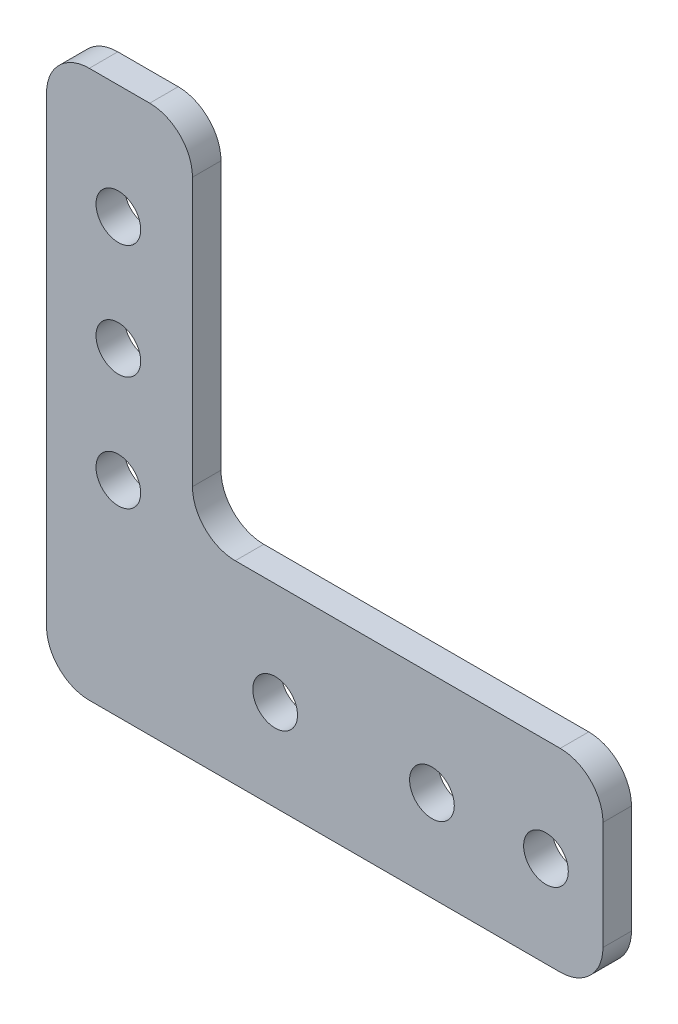
ISO-10303-21;
HEADER;
FILE_DESCRIPTION(('STEP AP214'),'2;1');
FILE_NAME('part.step','',(''),(''),'','','');
FILE_SCHEMA(('AUTOMOTIVE_DESIGN { 1 0 10303 214 1 1 1 1 }'));
ENDSEC;
DATA;
#1=APPLICATION_CONTEXT('core data for automotive mechanical design processes');
#2=APPLICATION_PROTOCOL_DEFINITION('international standard','automotive_design',2000,#1);
#3=PRODUCT_CONTEXT('',#1,'mechanical');
#4=PRODUCT('Part','Part','',(#3));
#5=PRODUCT_RELATED_PRODUCT_CATEGORY('part','',(#4));
#6=PRODUCT_DEFINITION_FORMATION('','',#4);
#7=PRODUCT_DEFINITION_CONTEXT('part definition',#1,'design');
#8=PRODUCT_DEFINITION('design','',#6,#7);
#9=PRODUCT_DEFINITION_SHAPE('','',#8);
#10=(LENGTH_UNIT() NAMED_UNIT(*) SI_UNIT(.MILLI.,.METRE.));
#11=(NAMED_UNIT(*) PLANE_ANGLE_UNIT() SI_UNIT($,.RADIAN.));
#12=(NAMED_UNIT(*) SI_UNIT($,.STERADIAN.) SOLID_ANGLE_UNIT());
#13=UNCERTAINTY_MEASURE_WITH_UNIT(LENGTH_MEASURE(1.E-05),#10,'distance_accuracy_value','');
#14=(GEOMETRIC_REPRESENTATION_CONTEXT(3) GLOBAL_UNCERTAINTY_ASSIGNED_CONTEXT((#13)) GLOBAL_UNIT_ASSIGNED_CONTEXT((#10,
#11,#12)) REPRESENTATION_CONTEXT('',''));
#15=CARTESIAN_POINT('',(0.,0.,0.));
#16=DIRECTION('',(0.,0.,1.));
#17=DIRECTION('',(1.,0.,0.));
#18=AXIS2_PLACEMENT_3D('',#15,#16,#17);
#19=CARTESIAN_POINT('',(-27.051,0.,3.175));
#20=DIRECTION('',(-1.,0.,0.));
#21=DIRECTION('',(0.,0.,1.));
#22=AXIS2_PLACEMENT_3D('',#19,#20,#21);
#23=PLANE('',#22);
#24=DIRECTION('',(0.,1.,0.));
#25=VECTOR('',#24,1.);
#26=CARTESIAN_POINT('',(-27.051,0.,3.175));
#27=LINE('',#26,#25);
#28=CARTESIAN_POINT('',(-27.051,-24.4475,3.175));
#29=VERTEX_POINT('',#28);
#30=CARTESIAN_POINT('',(-27.051,26.9875,3.175));
#31=VERTEX_POINT('',#30);
#32=EDGE_CURVE('E311',#29,#31,#27,.T.);
#33=ORIENTED_EDGE('',*,*,#32,.T.);
#34=DIRECTION('',(0.,0.,-1.));
#35=VECTOR('',#34,1.);
#36=CARTESIAN_POINT('',(-27.051,26.9875,3.175));
#37=LINE('',#36,#35);
#38=CARTESIAN_POINT('',(-27.051,26.9875,0.));
#39=VERTEX_POINT('',#38);
#40=EDGE_CURVE('E143',#31,#39,#37,.T.);
#41=ORIENTED_EDGE('',*,*,#40,.T.);
#42=DIRECTION('',(0.,1.,0.));
#43=VECTOR('',#42,1.);
#44=CARTESIAN_POINT('',(-27.051,0.,0.));
#45=LINE('',#44,#43);
#46=CARTESIAN_POINT('',(-27.051,-24.4475,0.));
#47=VERTEX_POINT('',#46);
#48=EDGE_CURVE('E134',#47,#39,#45,.T.);
#49=ORIENTED_EDGE('',*,*,#48,.F.);
#50=DIRECTION('',(0.,0.,-1.));
#51=VECTOR('',#50,1.);
#52=CARTESIAN_POINT('',(-27.051,-24.4475,3.175));
#53=LINE('',#52,#51);
#54=EDGE_CURVE('E148',#47,#29,#53,.F.);
#55=ORIENTED_EDGE('',*,*,#54,.T.);
#56=EDGE_LOOP('',(#33,#41,#49,#55));
#57=FACE_BOUND('',#56,.T.);
#58=ADVANCED_FACE('F41',(#57),#23,.T.);
#59=CARTESIAN_POINT('',(0.,-29.21,3.175));
#60=DIRECTION('',(0.,1.,0.));
#61=DIRECTION('',(0.,0.,1.));
#62=AXIS2_PLACEMENT_3D('',#59,#60,#61);
#63=PLANE('',#62);
#64=DIRECTION('',(1.,0.,0.));
#65=VECTOR('',#64,1.);
#66=CARTESIAN_POINT('',(0.,-29.21,0.));
#67=LINE('',#66,#65);
#68=CARTESIAN_POINT('',(-22.2885,-29.21,0.));
#69=VERTEX_POINT('',#68);
#70=CARTESIAN_POINT('',(30.1625,-29.21,0.));
#71=VERTEX_POINT('',#70);
#72=EDGE_CURVE('E136',#69,#71,#67,.T.);
#73=ORIENTED_EDGE('',*,*,#72,.T.);
#74=DIRECTION('',(0.,0.,-1.));
#75=VECTOR('',#74,1.);
#76=CARTESIAN_POINT('',(30.1625,-29.21,3.175));
#77=LINE('',#76,#75);
#78=CARTESIAN_POINT('',(30.1625,-29.21,3.175));
#79=VERTEX_POINT('',#78);
#80=EDGE_CURVE('E224',#71,#79,#77,.F.);
#81=ORIENTED_EDGE('',*,*,#80,.T.);
#82=DIRECTION('',(1.,0.,0.));
#83=VECTOR('',#82,1.);
#84=CARTESIAN_POINT('',(0.,-29.21,3.175));
#85=LINE('',#84,#83);
#86=CARTESIAN_POINT('',(-22.2885,-29.21,3.175));
#87=VERTEX_POINT('',#86);
#88=EDGE_CURVE('E314',#87,#79,#85,.T.);
#89=ORIENTED_EDGE('',*,*,#88,.F.);
#90=DIRECTION('',(0.,0.,-1.));
#91=VECTOR('',#90,1.);
#92=CARTESIAN_POINT('',(-22.2885,-29.21,0.));
#93=LINE('',#92,#91);
#94=EDGE_CURVE('E221',#87,#69,#93,.T.);
#95=ORIENTED_EDGE('',*,*,#94,.T.);
#96=EDGE_LOOP('',(#73,#81,#89,#95));
#97=FACE_BOUND('',#96,.T.);
#98=ADVANCED_FACE('F335',(#97),#63,.F.);
#99=CARTESIAN_POINT('',(34.925,0.,3.175));
#100=DIRECTION('',(-1.,0.,0.));
#101=DIRECTION('',(0.,0.,1.));
#102=AXIS2_PLACEMENT_3D('',#99,#100,#101);
#103=PLANE('',#102);
#104=DIRECTION('',(0.,1.,0.));
#105=VECTOR('',#104,1.);
#106=CARTESIAN_POINT('',(34.925,0.,0.));
#107=LINE('',#106,#105);
#108=CARTESIAN_POINT('',(34.925,-24.4475,0.));
#109=VERTEX_POINT('',#108);
#110=CARTESIAN_POINT('',(34.925,-12.3825,0.));
#111=VERTEX_POINT('',#110);
#112=EDGE_CURVE('E240',#109,#111,#107,.T.);
#113=ORIENTED_EDGE('',*,*,#112,.T.);
#114=DIRECTION('',(0.,0.,-1.));
#115=VECTOR('',#114,1.);
#116=CARTESIAN_POINT('',(34.925,-12.3825,3.175));
#117=LINE('',#116,#115);
#118=CARTESIAN_POINT('',(34.925,-12.3825,3.175));
#119=VERTEX_POINT('',#118);
#120=EDGE_CURVE('E218',#111,#119,#117,.F.);
#121=ORIENTED_EDGE('',*,*,#120,.T.);
#122=DIRECTION('',(0.,1.,0.));
#123=VECTOR('',#122,1.);
#124=CARTESIAN_POINT('',(34.925,0.,3.175));
#125=LINE('',#124,#123);
#126=CARTESIAN_POINT('',(34.925,-24.4475,3.175));
#127=VERTEX_POINT('',#126);
#128=EDGE_CURVE('E249',#127,#119,#125,.T.);
#129=ORIENTED_EDGE('',*,*,#128,.F.);
#130=DIRECTION('',(0.,0.,-1.));
#131=VECTOR('',#130,1.);
#132=CARTESIAN_POINT('',(34.925,-24.4475,3.175));
#133=LINE('',#132,#131);
#134=EDGE_CURVE('E214',#127,#109,#133,.T.);
#135=ORIENTED_EDGE('',*,*,#134,.T.);
#136=EDGE_LOOP('',(#113,#121,#129,#135));
#137=FACE_BOUND('',#136,.T.);
#138=ADVANCED_FACE('F330',(#137),#103,.F.);
#139=CARTESIAN_POINT('',(0.,-7.62000000000001,3.175));
#140=DIRECTION('',(0.,-1.,0.));
#141=DIRECTION('',(1.,0.,0.));
#142=AXIS2_PLACEMENT_3D('',#139,#140,#141);
#143=PLANE('',#142);
#144=DIRECTION('',(-1.,0.,0.));
#145=VECTOR('',#144,1.);
#146=CARTESIAN_POINT('',(0.,-7.62000000000001,0.));
#147=LINE('',#146,#145);
#148=CARTESIAN_POINT('',(30.1625,-7.62000000000001,0.));
#149=VERTEX_POINT('',#148);
#150=CARTESIAN_POINT('',(-6.0325,-7.62000000000002,0.));
#151=VERTEX_POINT('',#150);
#152=EDGE_CURVE('E230',#149,#151,#147,.T.);
#153=ORIENTED_EDGE('',*,*,#152,.T.);
#154=DIRECTION('',(0.,0.,-1.));
#155=VECTOR('',#154,1.);
#156=CARTESIAN_POINT('',(-6.0325,-7.62000000000002,3.175));
#157=LINE('',#156,#155);
#158=CARTESIAN_POINT('',(-6.0325,-7.62000000000002,3.175));
#159=VERTEX_POINT('',#158);
#160=EDGE_CURVE('E211',#151,#159,#157,.F.);
#161=ORIENTED_EDGE('',*,*,#160,.T.);
#162=DIRECTION('',(-1.,0.,0.));
#163=VECTOR('',#162,1.);
#164=CARTESIAN_POINT('',(0.,-7.62000000000001,3.175));
#165=LINE('',#164,#163);
#166=CARTESIAN_POINT('',(30.1625,-7.62000000000001,3.175));
#167=VERTEX_POINT('',#166);
#168=EDGE_CURVE('E246',#167,#159,#165,.T.);
#169=ORIENTED_EDGE('',*,*,#168,.F.);
#170=DIRECTION('',(0.,0.,-1.));
#171=VECTOR('',#170,1.);
#172=CARTESIAN_POINT('',(30.1625,-7.62000000000001,3.175));
#173=LINE('',#172,#171);
#174=EDGE_CURVE('E207',#167,#149,#173,.T.);
#175=ORIENTED_EDGE('',*,*,#174,.T.);
#176=EDGE_LOOP('',(#153,#161,#169,#175));
#177=FACE_BOUND('',#176,.T.);
#178=ADVANCED_FACE('F236',(#177),#143,.F.);
#179=CARTESIAN_POINT('',(-10.795,0.,3.175));
#180=DIRECTION('',(1.,0.,0.));
#181=DIRECTION('',(0.,1.,0.));
#182=AXIS2_PLACEMENT_3D('',#179,#180,#181);
#183=PLANE('',#182);
#184=DIRECTION('',(0.,-1.,0.));
#185=VECTOR('',#184,1.);
#186=CARTESIAN_POINT('',(-10.795,0.,0.));
#187=LINE('',#186,#185);
#188=CARTESIAN_POINT('',(-10.795,26.9875,0.));
#189=VERTEX_POINT('',#188);
#190=CARTESIAN_POINT('',(-10.795,-2.85750000000002,0.));
#191=VERTEX_POINT('',#190);
#192=EDGE_CURVE('E231',#189,#191,#187,.T.);
#193=ORIENTED_EDGE('',*,*,#192,.F.);
#194=DIRECTION('',(0.,0.,-1.));
#195=VECTOR('',#194,1.);
#196=CARTESIAN_POINT('',(-10.795,26.9875,3.175));
#197=LINE('',#196,#195);
#198=CARTESIAN_POINT('',(-10.795,26.9875,3.175));
#199=VERTEX_POINT('',#198);
#200=EDGE_CURVE('E62',#189,#199,#197,.F.);
#201=ORIENTED_EDGE('',*,*,#200,.T.);
#202=DIRECTION('',(0.,-1.,0.));
#203=VECTOR('',#202,1.);
#204=CARTESIAN_POINT('',(-10.795,0.,3.175));
#205=LINE('',#204,#203);
#206=CARTESIAN_POINT('',(-10.795,-2.85750000000002,3.175));
#207=VERTEX_POINT('',#206);
#208=EDGE_CURVE('E163',#199,#207,#205,.T.);
#209=ORIENTED_EDGE('',*,*,#208,.T.);
#210=DIRECTION('',(0.,0.,-1.));
#211=VECTOR('',#210,1.);
#212=CARTESIAN_POINT('',(-10.795,-2.85750000000002,3.175));
#213=LINE('',#212,#211);
#214=EDGE_CURVE('E201',#207,#191,#213,.T.);
#215=ORIENTED_EDGE('',*,*,#214,.T.);
#216=EDGE_LOOP('',(#193,#201,#209,#215));
#217=FACE_BOUND('',#216,.T.);
#218=ADVANCED_FACE('F243',(#217),#183,.T.);
#219=CARTESIAN_POINT('',(-19.05,-6.35000000000001,3.175));
#220=DIRECTION('',(0.,0.,-1.));
#221=DIRECTION('',(-1.,0.,0.));
#222=AXIS2_PLACEMENT_3D('',#219,#220,#221);
#223=CYLINDRICAL_SURFACE('',#222,2.4892);
#224=CARTESIAN_POINT('',(-19.05,-6.35000000000001,3.175));
#225=DIRECTION('',(0.,0.,1.));
#226=DIRECTION('',(1.,0.,0.));
#227=AXIS2_PLACEMENT_3D('',#224,#225,#226);
#228=CIRCLE('',#227,2.4892);
#229=CARTESIAN_POINT('',(-16.5608,-6.35000000000001,3.175));
#230=VERTEX_POINT('',#229);
#231=EDGE_CURVE('E307',#230,#230,#228,.T.);
#232=ORIENTED_EDGE('',*,*,#231,.T.);
#233=EDGE_LOOP('',(#232));
#234=FACE_BOUND('',#233,.T.);
#235=CARTESIAN_POINT('',(-19.05,-6.35000000000001,0.));
#236=DIRECTION('',(0.,0.,1.));
#237=DIRECTION('',(1.,0.,0.));
#238=AXIS2_PLACEMENT_3D('',#235,#236,#237);
#239=CIRCLE('',#238,2.4892);
#240=CARTESIAN_POINT('',(-16.5608,-6.35000000000001,0.));
#241=VERTEX_POINT('',#240);
#242=EDGE_CURVE('E152',#241,#241,#239,.T.);
#243=ORIENTED_EDGE('',*,*,#242,.F.);
#244=EDGE_LOOP('',(#243));
#245=FACE_BOUND('',#244,.T.);
#246=ADVANCED_FACE('F362',(#234,#245),#223,.F.);
#247=CARTESIAN_POINT('',(-19.05,6.34999999999999,3.175));
#248=DIRECTION('',(0.,0.,-1.));
#249=DIRECTION('',(-1.,0.,0.));
#250=AXIS2_PLACEMENT_3D('',#247,#248,#249);
#251=CYLINDRICAL_SURFACE('',#250,2.4892);
#252=CARTESIAN_POINT('',(-19.05,6.34999999999999,3.175));
#253=DIRECTION('',(0.,0.,1.));
#254=DIRECTION('',(1.,0.,0.));
#255=AXIS2_PLACEMENT_3D('',#252,#253,#254);
#256=CIRCLE('',#255,2.4892);
#257=CARTESIAN_POINT('',(-16.5608,6.34999999999999,3.175));
#258=VERTEX_POINT('',#257);
#259=EDGE_CURVE('E303',#258,#258,#256,.T.);
#260=ORIENTED_EDGE('',*,*,#259,.T.);
#261=EDGE_LOOP('',(#260));
#262=FACE_BOUND('',#261,.T.);
#263=CARTESIAN_POINT('',(-19.05,6.34999999999999,0.));
#264=DIRECTION('',(0.,0.,1.));
#265=DIRECTION('',(1.,0.,0.));
#266=AXIS2_PLACEMENT_3D('',#263,#264,#265);
#267=CIRCLE('',#266,2.4892);
#268=CARTESIAN_POINT('',(-16.5608,6.34999999999999,0.));
#269=VERTEX_POINT('',#268);
#270=EDGE_CURVE('E269',#269,#269,#267,.T.);
#271=ORIENTED_EDGE('',*,*,#270,.F.);
#272=EDGE_LOOP('',(#271));
#273=FACE_BOUND('',#272,.T.);
#274=ADVANCED_FACE('F365',(#262,#273),#251,.F.);
#275=CARTESIAN_POINT('',(-19.05,19.05,3.175));
#276=DIRECTION('',(0.,0.,-1.));
#277=DIRECTION('',(-1.,0.,0.));
#278=AXIS2_PLACEMENT_3D('',#275,#276,#277);
#279=CYLINDRICAL_SURFACE('',#278,2.4892);
#280=CARTESIAN_POINT('',(-19.05,19.05,3.175));
#281=DIRECTION('',(0.,0.,1.));
#282=DIRECTION('',(1.,0.,0.));
#283=AXIS2_PLACEMENT_3D('',#280,#281,#282);
#284=CIRCLE('',#283,2.4892);
#285=CARTESIAN_POINT('',(-16.5608,19.05,3.175));
#286=VERTEX_POINT('',#285);
#287=EDGE_CURVE('E299',#286,#286,#284,.T.);
#288=ORIENTED_EDGE('',*,*,#287,.T.);
#289=EDGE_LOOP('',(#288));
#290=FACE_BOUND('',#289,.T.);
#291=CARTESIAN_POINT('',(-19.05,19.05,0.));
#292=DIRECTION('',(0.,0.,1.));
#293=DIRECTION('',(1.,0.,0.));
#294=AXIS2_PLACEMENT_3D('',#291,#292,#293);
#295=CIRCLE('',#294,2.4892);
#296=CARTESIAN_POINT('',(-16.5608,19.05,0.));
#297=VERTEX_POINT('',#296);
#298=EDGE_CURVE('E265',#297,#297,#295,.T.);
#299=ORIENTED_EDGE('',*,*,#298,.F.);
#300=EDGE_LOOP('',(#299));
#301=FACE_BOUND('',#300,.T.);
#302=ADVANCED_FACE('F369',(#290,#301),#279,.F.);
#303=CARTESIAN_POINT('',(-1.58750000000001,-19.05,3.175));
#304=DIRECTION('',(0.,0.,-1.));
#305=DIRECTION('',(-1.,0.,0.));
#306=AXIS2_PLACEMENT_3D('',#303,#304,#305);
#307=CYLINDRICAL_SURFACE('',#306,2.4892);
#308=CARTESIAN_POINT('',(-1.58750000000001,-19.05,3.175));
#309=DIRECTION('',(0.,0.,1.));
#310=DIRECTION('',(1.,0.,0.));
#311=AXIS2_PLACEMENT_3D('',#308,#309,#310);
#312=CIRCLE('',#311,2.4892);
#313=CARTESIAN_POINT('',(0.901699999999994,-19.05,3.175));
#314=VERTEX_POINT('',#313);
#315=EDGE_CURVE('E293',#314,#314,#312,.T.);
#316=ORIENTED_EDGE('',*,*,#315,.T.);
#317=EDGE_LOOP('',(#316));
#318=FACE_BOUND('',#317,.T.);
#319=CARTESIAN_POINT('',(-1.58750000000001,-19.05,0.));
#320=DIRECTION('',(0.,0.,1.));
#321=DIRECTION('',(1.,0.,0.));
#322=AXIS2_PLACEMENT_3D('',#319,#320,#321);
#323=CIRCLE('',#322,2.4892);
#324=CARTESIAN_POINT('',(0.901699999999994,-19.05,0.));
#325=VERTEX_POINT('',#324);
#326=EDGE_CURVE('E261',#325,#325,#323,.T.);
#327=ORIENTED_EDGE('',*,*,#326,.F.);
#328=EDGE_LOOP('',(#327));
#329=FACE_BOUND('',#328,.T.);
#330=ADVANCED_FACE('F373',(#318,#329),#307,.F.);
#331=CARTESIAN_POINT('',(15.875,-19.05,3.175));
#332=DIRECTION('',(0.,0.,-1.));
#333=DIRECTION('',(-1.,0.,0.));
#334=AXIS2_PLACEMENT_3D('',#331,#332,#333);
#335=CYLINDRICAL_SURFACE('',#334,2.4892);
#336=CARTESIAN_POINT('',(15.875,-19.05,3.175));
#337=DIRECTION('',(0.,0.,1.));
#338=DIRECTION('',(1.,0.,0.));
#339=AXIS2_PLACEMENT_3D('',#336,#337,#338);
#340=CIRCLE('',#339,2.4892);
#341=CARTESIAN_POINT('',(18.3642,-19.05,3.175));
#342=VERTEX_POINT('',#341);
#343=EDGE_CURVE('E287',#342,#342,#340,.T.);
#344=ORIENTED_EDGE('',*,*,#343,.T.);
#345=EDGE_LOOP('',(#344));
#346=FACE_BOUND('',#345,.T.);
#347=CARTESIAN_POINT('',(15.875,-19.05,0.));
#348=DIRECTION('',(0.,0.,1.));
#349=DIRECTION('',(1.,0.,0.));
#350=AXIS2_PLACEMENT_3D('',#347,#348,#349);
#351=CIRCLE('',#350,2.4892);
#352=CARTESIAN_POINT('',(18.3642,-19.05,0.));
#353=VERTEX_POINT('',#352);
#354=EDGE_CURVE('E257',#353,#353,#351,.T.);
#355=ORIENTED_EDGE('',*,*,#354,.F.);
#356=EDGE_LOOP('',(#355));
#357=FACE_BOUND('',#356,.T.);
#358=ADVANCED_FACE('F377',(#346,#357),#335,.F.);
#359=CARTESIAN_POINT('',(28.575,-19.05,3.175));
#360=DIRECTION('',(0.,0.,-1.));
#361=DIRECTION('',(-1.,0.,0.));
#362=AXIS2_PLACEMENT_3D('',#359,#360,#361);
#363=CYLINDRICAL_SURFACE('',#362,2.4892);
#364=CARTESIAN_POINT('',(28.575,-19.05,3.175));
#365=DIRECTION('',(0.,0.,1.));
#366=DIRECTION('',(1.,0.,0.));
#367=AXIS2_PLACEMENT_3D('',#364,#365,#366);
#368=CIRCLE('',#367,2.4892);
#369=CARTESIAN_POINT('',(31.0642,-19.05,3.175));
#370=VERTEX_POINT('',#369);
#371=EDGE_CURVE('E283',#370,#370,#368,.T.);
#372=ORIENTED_EDGE('',*,*,#371,.T.);
#373=EDGE_LOOP('',(#372));
#374=FACE_BOUND('',#373,.T.);
#375=CARTESIAN_POINT('',(28.575,-19.05,0.));
#376=DIRECTION('',(0.,0.,1.));
#377=DIRECTION('',(1.,0.,0.));
#378=AXIS2_PLACEMENT_3D('',#375,#376,#377);
#379=CIRCLE('',#378,2.4892);
#380=CARTESIAN_POINT('',(31.0642,-19.05,0.));
#381=VERTEX_POINT('',#380);
#382=EDGE_CURVE('E253',#381,#381,#379,.T.);
#383=ORIENTED_EDGE('',*,*,#382,.F.);
#384=EDGE_LOOP('',(#383));
#385=FACE_BOUND('',#384,.T.);
#386=ADVANCED_FACE('F381',(#374,#385),#363,.F.);
#387=CARTESIAN_POINT('',(0.,31.75,3.175));
#388=DIRECTION('',(0.,1.,0.));
#389=DIRECTION('',(-1.,0.,0.));
#390=AXIS2_PLACEMENT_3D('',#387,#388,#389);
#391=PLANE('',#390);
#392=DIRECTION('',(1.,0.,0.));
#393=VECTOR('',#392,1.);
#394=CARTESIAN_POINT('',(0.,31.75,0.));
#395=LINE('',#394,#393);
#396=CARTESIAN_POINT('',(-22.2885,31.75,0.));
#397=VERTEX_POINT('',#396);
#398=CARTESIAN_POINT('',(-15.5575,31.75,0.));
#399=VERTEX_POINT('',#398);
#400=EDGE_CURVE('E166',#397,#399,#395,.T.);
#401=ORIENTED_EDGE('',*,*,#400,.F.);
#402=DIRECTION('',(0.,0.,-1.));
#403=VECTOR('',#402,1.);
#404=CARTESIAN_POINT('',(-22.2885,31.75,3.175));
#405=LINE('',#404,#403);
#406=CARTESIAN_POINT('',(-22.2885,31.75,3.175));
#407=VERTEX_POINT('',#406);
#408=EDGE_CURVE('E184',#397,#407,#405,.F.);
#409=ORIENTED_EDGE('',*,*,#408,.T.);
#410=DIRECTION('',(1.,0.,0.));
#411=VECTOR('',#410,1.);
#412=CARTESIAN_POINT('',(0.,31.75,3.175));
#413=LINE('',#412,#411);
#414=CARTESIAN_POINT('',(-15.5575,31.75,3.175));
#415=VERTEX_POINT('',#414);
#416=EDGE_CURVE('E157',#407,#415,#413,.T.);
#417=ORIENTED_EDGE('',*,*,#416,.T.);
#418=DIRECTION('',(0.,0.,-1.));
#419=VECTOR('',#418,1.);
#420=CARTESIAN_POINT('',(-15.5575,31.75,3.175));
#421=LINE('',#420,#419);
#422=EDGE_CURVE('E180',#415,#399,#421,.T.);
#423=ORIENTED_EDGE('',*,*,#422,.T.);
#424=EDGE_LOOP('',(#401,#409,#417,#423));
#425=FACE_BOUND('',#424,.T.);
#426=ADVANCED_FACE('F342',(#425),#391,.T.);
#427=CARTESIAN_POINT('',(0.,0.,3.175));
#428=DIRECTION('',(0.,0.,1.));
#429=DIRECTION('',(1.,0.,0.));
#430=AXIS2_PLACEMENT_3D('',#427,#428,#429);
#431=PLANE('',#430);
#432=ORIENTED_EDGE('',*,*,#371,.F.);
#433=EDGE_LOOP('',(#432));
#434=FACE_BOUND('',#433,.T.);
#435=ORIENTED_EDGE('',*,*,#343,.F.);
#436=EDGE_LOOP('',(#435));
#437=FACE_BOUND('',#436,.T.);
#438=ORIENTED_EDGE('',*,*,#315,.F.);
#439=EDGE_LOOP('',(#438));
#440=FACE_BOUND('',#439,.T.);
#441=ORIENTED_EDGE('',*,*,#287,.F.);
#442=EDGE_LOOP('',(#441));
#443=FACE_BOUND('',#442,.T.);
#444=ORIENTED_EDGE('',*,*,#259,.F.);
#445=EDGE_LOOP('',(#444));
#446=FACE_BOUND('',#445,.T.);
#447=ORIENTED_EDGE('',*,*,#231,.F.);
#448=EDGE_LOOP('',(#447));
#449=FACE_BOUND('',#448,.T.);
#450=ORIENTED_EDGE('',*,*,#416,.F.);
#451=CARTESIAN_POINT('',(-22.2885,26.9875,3.175));
#452=DIRECTION('',(0.,0.,1.));
#453=DIRECTION('',(1.,0.,0.));
#454=AXIS2_PLACEMENT_3D('',#451,#452,#453);
#455=CIRCLE('',#454,4.7625);
#456=EDGE_CURVE('E198',#407,#31,#455,.T.);
#457=ORIENTED_EDGE('',*,*,#456,.T.);
#458=ORIENTED_EDGE('',*,*,#32,.F.);
#459=CARTESIAN_POINT('',(-22.2885,-24.4475,3.175));
#460=DIRECTION('',(0.,0.,1.));
#461=DIRECTION('',(1.,0.,0.));
#462=AXIS2_PLACEMENT_3D('',#459,#460,#461);
#463=CIRCLE('',#462,4.7625);
#464=EDGE_CURVE('E155',#29,#87,#463,.T.);
#465=ORIENTED_EDGE('',*,*,#464,.T.);
#466=ORIENTED_EDGE('',*,*,#88,.T.);
#467=CARTESIAN_POINT('',(30.1625,-24.4475,3.175));
#468=DIRECTION('',(0.,0.,1.));
#469=DIRECTION('',(1.,0.,0.));
#470=AXIS2_PLACEMENT_3D('',#467,#468,#469);
#471=CIRCLE('',#470,4.7625);
#472=EDGE_CURVE('E189',#79,#127,#471,.T.);
#473=ORIENTED_EDGE('',*,*,#472,.T.);
#474=ORIENTED_EDGE('',*,*,#128,.T.);
#475=CARTESIAN_POINT('',(30.1625,-12.3825,3.175));
#476=DIRECTION('',(0.,0.,1.));
#477=DIRECTION('',(1.,0.,0.));
#478=AXIS2_PLACEMENT_3D('',#475,#476,#477);
#479=CIRCLE('',#478,4.7625);
#480=EDGE_CURVE('E192',#119,#167,#479,.T.);
#481=ORIENTED_EDGE('',*,*,#480,.T.);
#482=ORIENTED_EDGE('',*,*,#168,.T.);
#483=CARTESIAN_POINT('',(-6.0325,-2.85750000000001,3.175));
#484=DIRECTION('',(0.,0.,1.));
#485=DIRECTION('',(1.,0.,0.));
#486=AXIS2_PLACEMENT_3D('',#483,#484,#485);
#487=CIRCLE('',#486,4.7625);
#488=EDGE_CURVE('E11',#159,#207,#487,.F.);
#489=ORIENTED_EDGE('',*,*,#488,.T.);
#490=ORIENTED_EDGE('',*,*,#208,.F.);
#491=CARTESIAN_POINT('',(-15.5575,26.9875,3.175));
#492=DIRECTION('',(0.,0.,1.));
#493=DIRECTION('',(1.,0.,0.));
#494=AXIS2_PLACEMENT_3D('',#491,#492,#493);
#495=CIRCLE('',#494,4.7625);
#496=EDGE_CURVE('E195',#199,#415,#495,.T.);
#497=ORIENTED_EDGE('',*,*,#496,.T.);
#498=EDGE_LOOP('',(#450,#457,#458,#465,#466,#473,#474,#481,#482,#489,#490,#497));
#499=FACE_BOUND('',#498,.T.);
#500=ADVANCED_FACE('F322',(#434,#437,#440,#443,#446,#449,#499),#431,.T.);
#501=CARTESIAN_POINT('',(0.,0.,0.));
#502=DIRECTION('',(0.,0.,1.));
#503=DIRECTION('',(1.,0.,0.));
#504=AXIS2_PLACEMENT_3D('',#501,#502,#503);
#505=PLANE('',#504);
#506=ORIENTED_EDGE('',*,*,#382,.T.);
#507=EDGE_LOOP('',(#506));
#508=FACE_BOUND('',#507,.T.);
#509=ORIENTED_EDGE('',*,*,#354,.T.);
#510=EDGE_LOOP('',(#509));
#511=FACE_BOUND('',#510,.T.);
#512=ORIENTED_EDGE('',*,*,#326,.T.);
#513=EDGE_LOOP('',(#512));
#514=FACE_BOUND('',#513,.T.);
#515=ORIENTED_EDGE('',*,*,#298,.T.);
#516=EDGE_LOOP('',(#515));
#517=FACE_BOUND('',#516,.T.);
#518=ORIENTED_EDGE('',*,*,#270,.T.);
#519=EDGE_LOOP('',(#518));
#520=FACE_BOUND('',#519,.T.);
#521=ORIENTED_EDGE('',*,*,#242,.T.);
#522=EDGE_LOOP('',(#521));
#523=FACE_BOUND('',#522,.T.);
#524=ORIENTED_EDGE('',*,*,#48,.T.);
#525=CARTESIAN_POINT('',(-22.2885,26.9875,0.));
#526=DIRECTION('',(0.,0.,1.));
#527=DIRECTION('',(1.,0.,0.));
#528=AXIS2_PLACEMENT_3D('',#525,#526,#527);
#529=CIRCLE('',#528,4.7625);
#530=EDGE_CURVE('E177',#39,#397,#529,.F.);
#531=ORIENTED_EDGE('',*,*,#530,.T.);
#532=ORIENTED_EDGE('',*,*,#400,.T.);
#533=CARTESIAN_POINT('',(-15.5575,26.9875,0.));
#534=DIRECTION('',(0.,0.,1.));
#535=DIRECTION('',(1.,0.,0.));
#536=AXIS2_PLACEMENT_3D('',#533,#534,#535);
#537=CIRCLE('',#536,4.7625);
#538=EDGE_CURVE('E174',#399,#189,#537,.F.);
#539=ORIENTED_EDGE('',*,*,#538,.T.);
#540=ORIENTED_EDGE('',*,*,#192,.T.);
#541=CARTESIAN_POINT('',(-6.0325,-2.85750000000001,0.));
#542=DIRECTION('',(0.,0.,1.));
#543=DIRECTION('',(1.,0.,0.));
#544=AXIS2_PLACEMENT_3D('',#541,#542,#543);
#545=CIRCLE('',#544,4.7625);
#546=EDGE_CURVE('E50',#191,#151,#545,.T.);
#547=ORIENTED_EDGE('',*,*,#546,.T.);
#548=ORIENTED_EDGE('',*,*,#152,.F.);
#549=CARTESIAN_POINT('',(30.1625,-12.3825,0.));
#550=DIRECTION('',(0.,0.,1.));
#551=DIRECTION('',(1.,0.,0.));
#552=AXIS2_PLACEMENT_3D('',#549,#550,#551);
#553=CIRCLE('',#552,4.7625);
#554=EDGE_CURVE('E171',#149,#111,#553,.F.);
#555=ORIENTED_EDGE('',*,*,#554,.T.);
#556=ORIENTED_EDGE('',*,*,#112,.F.);
#557=CARTESIAN_POINT('',(30.1625,-24.4475,0.));
#558=DIRECTION('',(0.,0.,1.));
#559=DIRECTION('',(1.,0.,0.));
#560=AXIS2_PLACEMENT_3D('',#557,#558,#559);
#561=CIRCLE('',#560,4.7625);
#562=EDGE_CURVE('E142',#109,#71,#561,.F.);
#563=ORIENTED_EDGE('',*,*,#562,.T.);
#564=ORIENTED_EDGE('',*,*,#72,.F.);
#565=CARTESIAN_POINT('',(-22.2885,-24.4475,0.));
#566=DIRECTION('',(0.,0.,1.));
#567=DIRECTION('',(1.,0.,0.));
#568=AXIS2_PLACEMENT_3D('',#565,#566,#567);
#569=CIRCLE('',#568,4.7625);
#570=EDGE_CURVE('E131',#69,#47,#569,.F.);
#571=ORIENTED_EDGE('',*,*,#570,.T.);
#572=EDGE_LOOP('',(#524,#531,#532,#539,#540,#547,#548,#555,#556,#563,#564,#571));
#573=FACE_BOUND('',#572,.T.);
#574=ADVANCED_FACE('F133',(#508,#511,#514,#517,#520,#523,#573),#505,.F.);
#575=CARTESIAN_POINT('',(-22.2885,26.9875,3.175));
#576=DIRECTION('',(0.,0.,-1.));
#577=DIRECTION('',(-1.,0.,0.));
#578=AXIS2_PLACEMENT_3D('',#575,#576,#577);
#579=CYLINDRICAL_SURFACE('',#578,4.7625);
#580=ORIENTED_EDGE('',*,*,#456,.F.);
#581=ORIENTED_EDGE('',*,*,#408,.F.);
#582=ORIENTED_EDGE('',*,*,#530,.F.);
#583=ORIENTED_EDGE('',*,*,#40,.F.);
#584=EDGE_LOOP('',(#580,#581,#582,#583));
#585=FACE_BOUND('',#584,.T.);
#586=ADVANCED_FACE('F339',(#585),#579,.T.);
#587=CARTESIAN_POINT('',(-15.5575,26.9875,3.175));
#588=DIRECTION('',(0.,0.,-1.));
#589=DIRECTION('',(-1.,0.,0.));
#590=AXIS2_PLACEMENT_3D('',#587,#588,#589);
#591=CYLINDRICAL_SURFACE('',#590,4.7625);
#592=ORIENTED_EDGE('',*,*,#496,.F.);
#593=ORIENTED_EDGE('',*,*,#200,.F.);
#594=ORIENTED_EDGE('',*,*,#538,.F.);
#595=ORIENTED_EDGE('',*,*,#422,.F.);
#596=EDGE_LOOP('',(#592,#593,#594,#595));
#597=FACE_BOUND('',#596,.T.);
#598=ADVANCED_FACE('F345',(#597),#591,.T.);
#599=CARTESIAN_POINT('',(-6.0325,-2.85750000000001,3.175));
#600=DIRECTION('',(0.,0.,-1.));
#601=DIRECTION('',(-1.,0.,0.));
#602=AXIS2_PLACEMENT_3D('',#599,#600,#601);
#603=CYLINDRICAL_SURFACE('',#602,4.7625);
#604=ORIENTED_EDGE('',*,*,#488,.F.);
#605=ORIENTED_EDGE('',*,*,#160,.F.);
#606=ORIENTED_EDGE('',*,*,#546,.F.);
#607=ORIENTED_EDGE('',*,*,#214,.F.);
#608=EDGE_LOOP('',(#604,#605,#606,#607));
#609=FACE_BOUND('',#608,.T.);
#610=ADVANCED_FACE('F242',(#609),#603,.F.);
#611=CARTESIAN_POINT('',(30.1625,-12.3825,3.175));
#612=DIRECTION('',(0.,0.,-1.));
#613=DIRECTION('',(-1.,0.,0.));
#614=AXIS2_PLACEMENT_3D('',#611,#612,#613);
#615=CYLINDRICAL_SURFACE('',#614,4.7625);
#616=ORIENTED_EDGE('',*,*,#480,.F.);
#617=ORIENTED_EDGE('',*,*,#120,.F.);
#618=ORIENTED_EDGE('',*,*,#554,.F.);
#619=ORIENTED_EDGE('',*,*,#174,.F.);
#620=EDGE_LOOP('',(#616,#617,#618,#619));
#621=FACE_BOUND('',#620,.T.);
#622=ADVANCED_FACE('F328',(#621),#615,.T.);
#623=CARTESIAN_POINT('',(30.1625,-24.4475,3.175));
#624=DIRECTION('',(0.,0.,-1.));
#625=DIRECTION('',(-1.,0.,0.));
#626=AXIS2_PLACEMENT_3D('',#623,#624,#625);
#627=CYLINDRICAL_SURFACE('',#626,4.7625);
#628=ORIENTED_EDGE('',*,*,#472,.F.);
#629=ORIENTED_EDGE('',*,*,#80,.F.);
#630=ORIENTED_EDGE('',*,*,#562,.F.);
#631=ORIENTED_EDGE('',*,*,#134,.F.);
#632=EDGE_LOOP('',(#628,#629,#630,#631));
#633=FACE_BOUND('',#632,.T.);
#634=ADVANCED_FACE('F332',(#633),#627,.T.);
#635=CARTESIAN_POINT('',(-22.2885,-24.4475,3.175));
#636=DIRECTION('',(0.,0.,1.));
#637=DIRECTION('',(1.,0.,0.));
#638=AXIS2_PLACEMENT_3D('',#635,#636,#637);
#639=CYLINDRICAL_SURFACE('',#638,4.7625);
#640=ORIENTED_EDGE('',*,*,#464,.F.);
#641=ORIENTED_EDGE('',*,*,#54,.F.);
#642=ORIENTED_EDGE('',*,*,#570,.F.);
#643=ORIENTED_EDGE('',*,*,#94,.F.);
#644=EDGE_LOOP('',(#640,#641,#642,#643));
#645=FACE_BOUND('',#644,.T.);
#646=ADVANCED_FACE('F43',(#645),#639,.T.);
#647=CLOSED_SHELL('',(#58,#98,#138,#178,#218,#246,#274,#302,#330,#358,#386,#426,#500,#574,#586,
#598,#610,#622,#634,#646));
#648=MANIFOLD_SOLID_BREP('B2',#647);
#649=ADVANCED_BREP_SHAPE_REPRESENTATION('',(#18,#648),#14);
#650=SHAPE_DEFINITION_REPRESENTATION(#9,#649);
ENDSEC;
END-ISO-10303-21;
